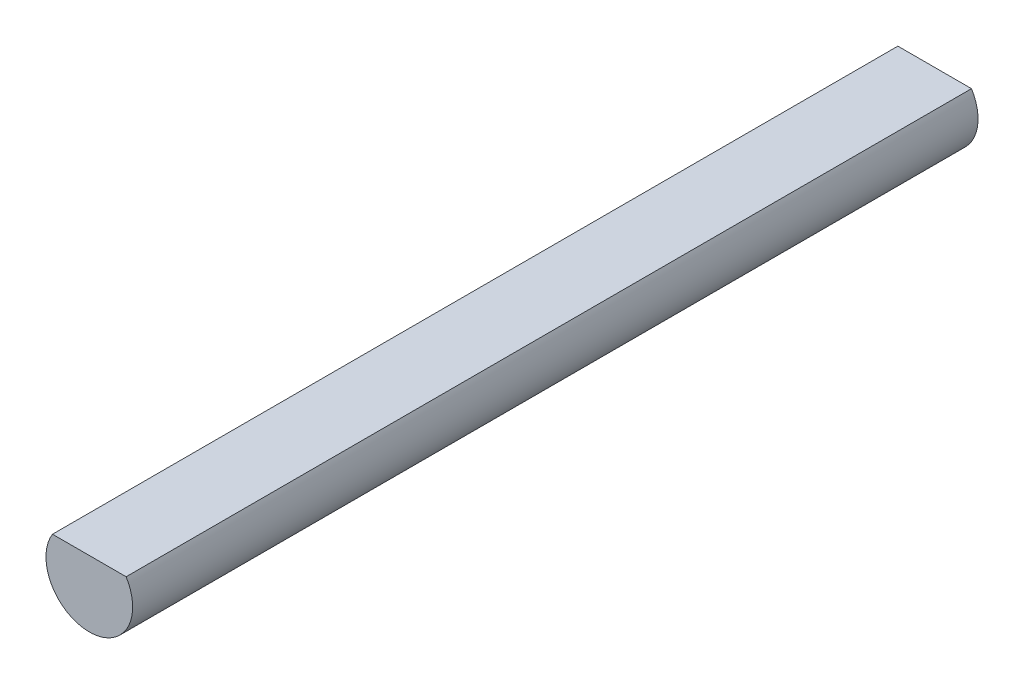
ISO-10303-21;
HEADER;
FILE_DESCRIPTION(('STEP AP214'),'2;1');
FILE_NAME('part.step','',(''),(''),'','','');
FILE_SCHEMA(('AUTOMOTIVE_DESIGN { 1 0 10303 214 1 1 1 1 }'));
ENDSEC;
DATA;
#1=APPLICATION_CONTEXT('core data for automotive mechanical design processes');
#2=APPLICATION_PROTOCOL_DEFINITION('international standard','automotive_design',2000,#1);
#3=PRODUCT_CONTEXT('',#1,'mechanical');
#4=PRODUCT('Part','Part','',(#3));
#5=PRODUCT_RELATED_PRODUCT_CATEGORY('part','',(#4));
#6=PRODUCT_DEFINITION_FORMATION('','',#4);
#7=PRODUCT_DEFINITION_CONTEXT('part definition',#1,'design');
#8=PRODUCT_DEFINITION('design','',#6,#7);
#9=PRODUCT_DEFINITION_SHAPE('','',#8);
#10=(LENGTH_UNIT() NAMED_UNIT(*) SI_UNIT(.MILLI.,.METRE.));
#11=(NAMED_UNIT(*) PLANE_ANGLE_UNIT() SI_UNIT($,.RADIAN.));
#12=(NAMED_UNIT(*) SI_UNIT($,.STERADIAN.) SOLID_ANGLE_UNIT());
#13=UNCERTAINTY_MEASURE_WITH_UNIT(LENGTH_MEASURE(1.E-05),#10,'distance_accuracy_value','');
#14=(GEOMETRIC_REPRESENTATION_CONTEXT(3) GLOBAL_UNCERTAINTY_ASSIGNED_CONTEXT((#13)) GLOBAL_UNIT_ASSIGNED_CONTEXT((#10,
#11,#12)) REPRESENTATION_CONTEXT('',''));
#15=CARTESIAN_POINT('',(0.,0.,0.));
#16=DIRECTION('',(0.,0.,1.));
#17=DIRECTION('',(1.,0.,0.));
#18=AXIS2_PLACEMENT_3D('',#15,#16,#17);
#19=CARTESIAN_POINT('',(0.,-15.5555555555556,287.));
#20=DIRECTION('',(0.,0.,-1.));
#21=DIRECTION('',(-1.,0.,0.));
#22=AXIS2_PLACEMENT_3D('',#19,#20,#21);
#23=CYLINDRICAL_SURFACE('',#22,29.4444444444444);
#24=CARTESIAN_POINT('',(0.,-15.5555555555556,-287.));
#25=DIRECTION('',(0.,0.,1.));
#26=DIRECTION('',(1.,0.,0.));
#27=AXIS2_PLACEMENT_3D('',#24,#25,#26);
#28=CIRCLE('',#27,29.4444444444444);
#29=CARTESIAN_POINT('',(-25.,0.,-287.));
#30=VERTEX_POINT('',#29);
#31=CARTESIAN_POINT('',(25.,0.,-287.));
#32=VERTEX_POINT('',#31);
#33=EDGE_CURVE('E66',#30,#32,#28,.T.);
#34=ORIENTED_EDGE('',*,*,#33,.T.);
#35=DIRECTION('',(0.,0.,-1.));
#36=VECTOR('',#35,1.);
#37=CARTESIAN_POINT('',(25.,0.,287.));
#38=LINE('',#37,#36);
#39=CARTESIAN_POINT('',(25.,0.,287.));
#40=VERTEX_POINT('',#39);
#41=EDGE_CURVE('E11',#40,#32,#38,.T.);
#42=ORIENTED_EDGE('',*,*,#41,.F.);
#43=CARTESIAN_POINT('',(0.,-15.5555555555556,287.));
#44=DIRECTION('',(0.,0.,1.));
#45=DIRECTION('',(1.,0.,0.));
#46=AXIS2_PLACEMENT_3D('',#43,#44,#45);
#47=CIRCLE('',#46,29.4444444444444);
#48=CARTESIAN_POINT('',(-25.,0.,287.));
#49=VERTEX_POINT('',#48);
#50=EDGE_CURVE('E65',#49,#40,#47,.T.);
#51=ORIENTED_EDGE('',*,*,#50,.F.);
#52=DIRECTION('',(0.,0.,-1.));
#53=VECTOR('',#52,1.);
#54=CARTESIAN_POINT('',(-25.,0.,287.));
#55=LINE('',#54,#53);
#56=EDGE_CURVE('E43',#49,#30,#55,.T.);
#57=ORIENTED_EDGE('',*,*,#56,.T.);
#58=EDGE_LOOP('',(#34,#42,#51,#57));
#59=FACE_BOUND('',#58,.T.);
#60=ADVANCED_FACE('F35',(#59),#23,.T.);
#61=CARTESIAN_POINT('',(-25.,0.,287.));
#62=DIRECTION('',(0.,-1.,0.));
#63=DIRECTION('',(0.,0.,-1.));
#64=AXIS2_PLACEMENT_3D('',#61,#62,#63);
#65=PLANE('',#64);
#66=DIRECTION('',(-1.,0.,0.));
#67=VECTOR('',#66,1.);
#68=CARTESIAN_POINT('',(-25.,0.,-287.));
#69=LINE('',#68,#67);
#70=EDGE_CURVE('E58',#32,#30,#69,.T.);
#71=ORIENTED_EDGE('',*,*,#70,.T.);
#72=ORIENTED_EDGE('',*,*,#56,.F.);
#73=DIRECTION('',(-1.,0.,0.));
#74=VECTOR('',#73,1.);
#75=CARTESIAN_POINT('',(-25.,0.,287.));
#76=LINE('',#75,#74);
#77=EDGE_CURVE('E50',#40,#49,#76,.T.);
#78=ORIENTED_EDGE('',*,*,#77,.F.);
#79=ORIENTED_EDGE('',*,*,#41,.T.);
#80=EDGE_LOOP('',(#71,#72,#78,#79));
#81=FACE_BOUND('',#80,.T.);
#82=ADVANCED_FACE('F61',(#81),#65,.F.);
#83=CARTESIAN_POINT('',(0.,-15.5555555555556,287.));
#84=DIRECTION('',(0.,0.,1.));
#85=DIRECTION('',(1.,0.,0.));
#86=AXIS2_PLACEMENT_3D('',#83,#84,#85);
#87=PLANE('',#86);
#88=ORIENTED_EDGE('',*,*,#50,.T.);
#89=ORIENTED_EDGE('',*,*,#77,.T.);
#90=EDGE_LOOP('',(#88,#89));
#91=FACE_BOUND('',#90,.T.);
#92=ADVANCED_FACE('F73',(#91),#87,.T.);
#93=CARTESIAN_POINT('',(0.,-15.5555555555556,-287.));
#94=DIRECTION('',(0.,0.,1.));
#95=DIRECTION('',(1.,0.,0.));
#96=AXIS2_PLACEMENT_3D('',#93,#94,#95);
#97=PLANE('',#96);
#98=ORIENTED_EDGE('',*,*,#33,.F.);
#99=ORIENTED_EDGE('',*,*,#70,.F.);
#100=EDGE_LOOP('',(#98,#99));
#101=FACE_BOUND('',#100,.T.);
#102=ADVANCED_FACE('F69',(#101),#97,.F.);
#103=CLOSED_SHELL('',(#60,#82,#92,#102));
#104=MANIFOLD_SOLID_BREP('B2',#103);
#105=ADVANCED_BREP_SHAPE_REPRESENTATION('',(#18,#104),#14);
#106=SHAPE_DEFINITION_REPRESENTATION(#9,#105);
ENDSEC;
END-ISO-10303-21;
